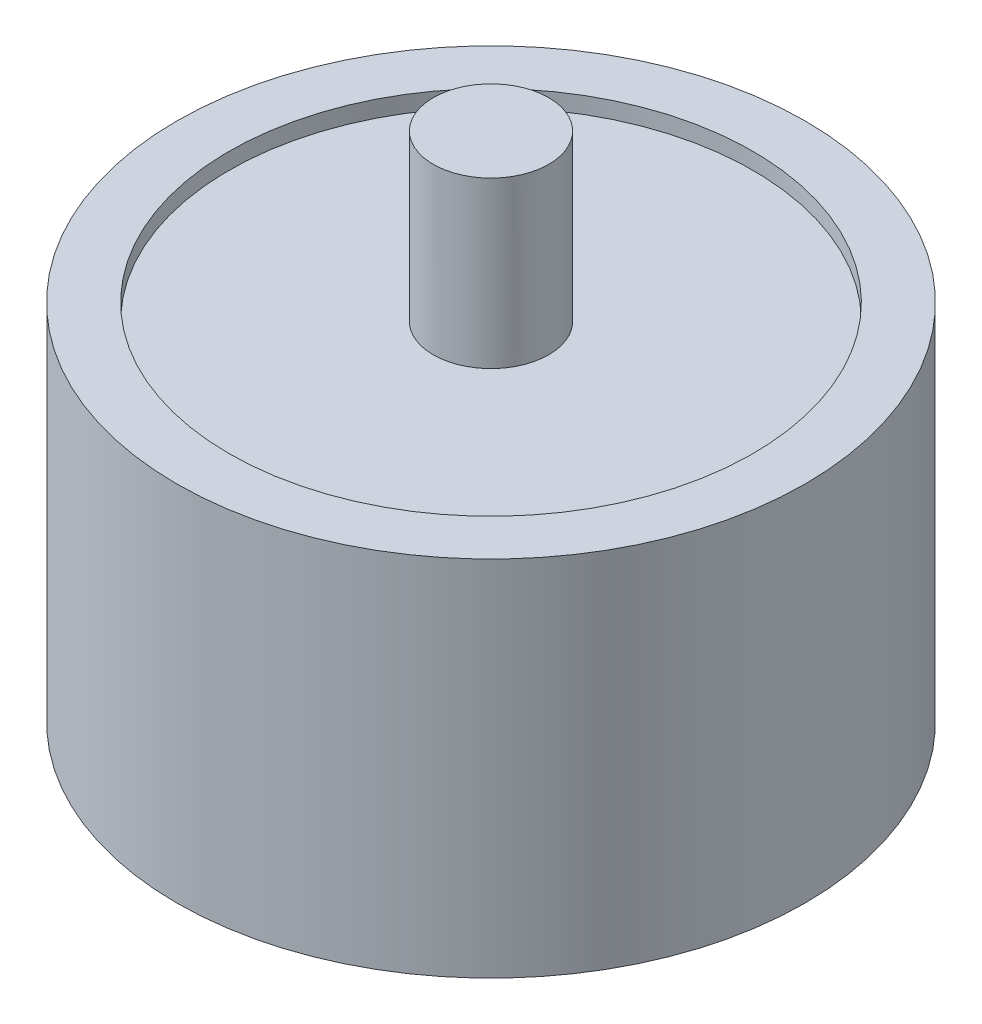
ISO-10303-21;
HEADER;
FILE_DESCRIPTION(('STEP AP214'),'2;1');
FILE_NAME('part.step','',(''),(''),'','','');
FILE_SCHEMA(('AUTOMOTIVE_DESIGN { 1 0 10303 214 1 1 1 1 }'));
ENDSEC;
DATA;
#1=APPLICATION_CONTEXT('core data for automotive mechanical design processes');
#2=APPLICATION_PROTOCOL_DEFINITION('international standard','automotive_design',2000,#1);
#3=PRODUCT_CONTEXT('',#1,'mechanical');
#4=PRODUCT('Part','Part','',(#3));
#5=PRODUCT_RELATED_PRODUCT_CATEGORY('part','',(#4));
#6=PRODUCT_DEFINITION_FORMATION('','',#4);
#7=PRODUCT_DEFINITION_CONTEXT('part definition',#1,'design');
#8=PRODUCT_DEFINITION('design','',#6,#7);
#9=PRODUCT_DEFINITION_SHAPE('','',#8);
#10=(LENGTH_UNIT() NAMED_UNIT(*) SI_UNIT(.MILLI.,.METRE.));
#11=(NAMED_UNIT(*) PLANE_ANGLE_UNIT() SI_UNIT($,.RADIAN.));
#12=(NAMED_UNIT(*) SI_UNIT($,.STERADIAN.) SOLID_ANGLE_UNIT());
#13=UNCERTAINTY_MEASURE_WITH_UNIT(LENGTH_MEASURE(1.E-05),#10,'distance_accuracy_value','');
#14=(GEOMETRIC_REPRESENTATION_CONTEXT(3) GLOBAL_UNCERTAINTY_ASSIGNED_CONTEXT((#13)) GLOBAL_UNIT_ASSIGNED_CONTEXT((#10,
#11,#12)) REPRESENTATION_CONTEXT('',''));
#15=CARTESIAN_POINT('',(0.,0.,0.));
#16=DIRECTION('',(0.,0.,1.));
#17=DIRECTION('',(1.,0.,0.));
#18=AXIS2_PLACEMENT_3D('',#15,#16,#17);
#19=CARTESIAN_POINT('',(0.,20.,0.));
#20=DIRECTION('',(0.,1.,0.));
#21=DIRECTION('',(0.,0.,1.));
#22=AXIS2_PLACEMENT_3D('',#19,#20,#21);
#23=PLANE('',#22);
#24=CARTESIAN_POINT('',(0.,20.,0.));
#25=DIRECTION('',(0.,1.,0.));
#26=DIRECTION('',(0.,0.,1.));
#27=AXIS2_PLACEMENT_3D('',#24,#25,#26);
#28=CIRCLE('',#27,3.5);
#29=CARTESIAN_POINT('',(0.,20.,3.5));
#30=VERTEX_POINT('',#29);
#31=EDGE_CURVE('E10',#30,#30,#28,.T.);
#32=ORIENTED_EDGE('',*,*,#31,.F.);
#33=EDGE_LOOP('',(#32));
#34=FACE_BOUND('',#33,.T.);
#35=CARTESIAN_POINT('',(0.,20.,0.));
#36=DIRECTION('',(0.,1.,0.));
#37=DIRECTION('',(0.,0.,1.));
#38=AXIS2_PLACEMENT_3D('',#35,#36,#37);
#39=CIRCLE('',#38,15.875);
#40=CARTESIAN_POINT('',(0.,20.,15.875));
#41=VERTEX_POINT('',#40);
#42=EDGE_CURVE('E51',#41,#41,#39,.F.);
#43=ORIENTED_EDGE('',*,*,#42,.F.);
#44=EDGE_LOOP('',(#43));
#45=FACE_BOUND('',#44,.T.);
#46=ADVANCED_FACE('F31',(#34,#45),#23,.T.);
#47=CARTESIAN_POINT('',(0.,30.,0.));
#48=DIRECTION('',(0.,-1.,0.));
#49=DIRECTION('',(0.,0.,-1.));
#50=AXIS2_PLACEMENT_3D('',#47,#48,#49);
#51=CYLINDRICAL_SURFACE('',#50,3.5);
#52=ORIENTED_EDGE('',*,*,#31,.T.);
#53=EDGE_LOOP('',(#52));
#54=FACE_BOUND('',#53,.T.);
#55=CARTESIAN_POINT('',(0.,30.,0.));
#56=DIRECTION('',(0.,-1.,0.));
#57=DIRECTION('',(0.,0.,-1.));
#58=AXIS2_PLACEMENT_3D('',#55,#56,#57);
#59=CIRCLE('',#58,3.5);
#60=CARTESIAN_POINT('',(0.,30.,-3.5));
#61=VERTEX_POINT('',#60);
#62=EDGE_CURVE('E45',#61,#61,#59,.T.);
#63=ORIENTED_EDGE('',*,*,#62,.T.);
#64=EDGE_LOOP('',(#63));
#65=FACE_BOUND('',#64,.T.);
#66=ADVANCED_FACE('F88',(#54,#65),#51,.T.);
#67=CARTESIAN_POINT('',(0.,30.,0.));
#68=DIRECTION('',(0.,-1.,0.));
#69=DIRECTION('',(0.,0.,-1.));
#70=AXIS2_PLACEMENT_3D('',#67,#68,#69);
#71=PLANE('',#70);
#72=ORIENTED_EDGE('',*,*,#62,.F.);
#73=EDGE_LOOP('',(#72));
#74=FACE_BOUND('',#73,.T.);
#75=ADVANCED_FACE('F74',(#74),#71,.F.);
#76=CARTESIAN_POINT('',(0.,21.,0.));
#77=DIRECTION('',(0.,-1.,0.));
#78=DIRECTION('',(0.,0.,-1.));
#79=AXIS2_PLACEMENT_3D('',#76,#77,#78);
#80=CYLINDRICAL_SURFACE('',#79,15.875);
#81=CARTESIAN_POINT('',(0.,-1.,0.));
#82=DIRECTION('',(0.,1.,0.));
#83=DIRECTION('',(0.,0.,1.));
#84=AXIS2_PLACEMENT_3D('',#81,#82,#83);
#85=CIRCLE('',#84,15.875);
#86=CARTESIAN_POINT('',(0.,-1.,15.875));
#87=VERTEX_POINT('',#86);
#88=EDGE_CURVE('E63',#87,#87,#85,.T.);
#89=ORIENTED_EDGE('',*,*,#88,.F.);
#90=EDGE_LOOP('',(#89));
#91=FACE_BOUND('',#90,.T.);
#92=CARTESIAN_POINT('',(0.,0.,0.));
#93=DIRECTION('',(0.,1.,0.));
#94=DIRECTION('',(0.,0.,1.));
#95=AXIS2_PLACEMENT_3D('',#92,#93,#94);
#96=CIRCLE('',#95,15.875);
#97=CARTESIAN_POINT('',(0.,0.,15.875));
#98=VERTEX_POINT('',#97);
#99=EDGE_CURVE('E39',#98,#98,#96,.T.);
#100=ORIENTED_EDGE('',*,*,#99,.T.);
#101=EDGE_LOOP('',(#100));
#102=FACE_BOUND('',#101,.T.);
#103=ADVANCED_FACE('F70',(#91,#102),#80,.F.);
#104=CARTESIAN_POINT('',(0.,21.,0.));
#105=DIRECTION('',(0.,1.,0.));
#106=DIRECTION('',(0.,0.,1.));
#107=AXIS2_PLACEMENT_3D('',#104,#105,#106);
#108=PLANE('',#107);
#109=CARTESIAN_POINT('',(0.,21.,0.));
#110=DIRECTION('',(0.,1.,0.));
#111=DIRECTION('',(0.,0.,1.));
#112=AXIS2_PLACEMENT_3D('',#109,#110,#111);
#113=CIRCLE('',#112,19.05);
#114=CARTESIAN_POINT('',(0.,21.,19.05));
#115=VERTEX_POINT('',#114);
#116=EDGE_CURVE('E54',#115,#115,#113,.T.);
#117=ORIENTED_EDGE('',*,*,#116,.T.);
#118=EDGE_LOOP('',(#117));
#119=FACE_BOUND('',#118,.T.);
#120=CARTESIAN_POINT('',(0.,21.,0.));
#121=DIRECTION('',(0.,1.,0.));
#122=DIRECTION('',(0.,0.,1.));
#123=AXIS2_PLACEMENT_3D('',#120,#121,#122);
#124=CIRCLE('',#123,15.875);
#125=CARTESIAN_POINT('',(0.,21.,15.875));
#126=VERTEX_POINT('',#125);
#127=EDGE_CURVE('E57',#126,#126,#124,.T.);
#128=ORIENTED_EDGE('',*,*,#127,.F.);
#129=EDGE_LOOP('',(#128));
#130=FACE_BOUND('',#129,.T.);
#131=ADVANCED_FACE('F73',(#119,#130),#108,.T.);
#132=CARTESIAN_POINT('',(0.,21.,0.));
#133=DIRECTION('',(0.,-1.,0.));
#134=DIRECTION('',(0.,0.,-1.));
#135=AXIS2_PLACEMENT_3D('',#132,#133,#134);
#136=CYLINDRICAL_SURFACE('',#135,19.05);
#137=ORIENTED_EDGE('',*,*,#116,.F.);
#138=EDGE_LOOP('',(#137));
#139=FACE_BOUND('',#138,.T.);
#140=CARTESIAN_POINT('',(0.,-1.,0.));
#141=DIRECTION('',(0.,1.,0.));
#142=DIRECTION('',(0.,0.,1.));
#143=AXIS2_PLACEMENT_3D('',#140,#141,#142);
#144=CIRCLE('',#143,19.05);
#145=CARTESIAN_POINT('',(0.,-1.,19.05));
#146=VERTEX_POINT('',#145);
#147=EDGE_CURVE('E60',#146,#146,#144,.T.);
#148=ORIENTED_EDGE('',*,*,#147,.T.);
#149=EDGE_LOOP('',(#148));
#150=FACE_BOUND('',#149,.T.);
#151=ADVANCED_FACE('F103',(#139,#150),#136,.T.);
#152=ORIENTED_EDGE('',*,*,#42,.T.);
#153=EDGE_LOOP('',(#152));
#154=FACE_BOUND('',#153,.T.);
#155=ORIENTED_EDGE('',*,*,#127,.T.);
#156=EDGE_LOOP('',(#155));
#157=FACE_BOUND('',#156,.T.);
#158=ADVANCED_FACE('F76',(#154,#157),#80,.F.);
#159=CARTESIAN_POINT('',(0.,-1.,0.));
#160=DIRECTION('',(0.,1.,0.));
#161=DIRECTION('',(0.,0.,1.));
#162=AXIS2_PLACEMENT_3D('',#159,#160,#161);
#163=PLANE('',#162);
#164=ORIENTED_EDGE('',*,*,#88,.T.);
#165=EDGE_LOOP('',(#164));
#166=FACE_BOUND('',#165,.T.);
#167=ORIENTED_EDGE('',*,*,#147,.F.);
#168=EDGE_LOOP('',(#167));
#169=FACE_BOUND('',#168,.T.);
#170=ADVANCED_FACE('F67',(#166,#169),#163,.F.);
#171=CARTESIAN_POINT('',(0.,-10.,0.));
#172=DIRECTION('',(0.,-1.,0.));
#173=DIRECTION('',(0.,0.,-1.));
#174=AXIS2_PLACEMENT_3D('',#171,#172,#173);
#175=PLANE('',#174);
#176=CARTESIAN_POINT('',(0.,-10.,0.));
#177=DIRECTION('',(0.,-1.,0.));
#178=DIRECTION('',(0.,0.,-1.));
#179=AXIS2_PLACEMENT_3D('',#176,#177,#178);
#180=CIRCLE('',#179,3.5);
#181=CARTESIAN_POINT('',(0.,-10.,-3.5));
#182=VERTEX_POINT('',#181);
#183=EDGE_CURVE('E48',#182,#182,#180,.T.);
#184=ORIENTED_EDGE('',*,*,#183,.T.);
#185=EDGE_LOOP('',(#184));
#186=FACE_BOUND('',#185,.T.);
#187=ADVANCED_FACE('F85',(#186),#175,.T.);
#188=ORIENTED_EDGE('',*,*,#183,.F.);
#189=EDGE_LOOP('',(#188));
#190=FACE_BOUND('',#189,.T.);
#191=CARTESIAN_POINT('',(0.,0.,0.));
#192=DIRECTION('',(0.,1.,0.));
#193=DIRECTION('',(0.,0.,1.));
#194=AXIS2_PLACEMENT_3D('',#191,#192,#193);
#195=CIRCLE('',#194,3.5);
#196=CARTESIAN_POINT('',(0.,0.,3.5));
#197=VERTEX_POINT('',#196);
#198=EDGE_CURVE('E35',#197,#197,#195,.T.);
#199=ORIENTED_EDGE('',*,*,#198,.F.);
#200=EDGE_LOOP('',(#199));
#201=FACE_BOUND('',#200,.T.);
#202=ADVANCED_FACE('F80',(#190,#201),#51,.T.);
#203=CARTESIAN_POINT('',(0.,0.,0.));
#204=DIRECTION('',(0.,1.,0.));
#205=DIRECTION('',(0.,0.,1.));
#206=AXIS2_PLACEMENT_3D('',#203,#204,#205);
#207=PLANE('',#206);
#208=ORIENTED_EDGE('',*,*,#198,.T.);
#209=EDGE_LOOP('',(#208));
#210=FACE_BOUND('',#209,.T.);
#211=ORIENTED_EDGE('',*,*,#99,.F.);
#212=EDGE_LOOP('',(#211));
#213=FACE_BOUND('',#212,.T.);
#214=ADVANCED_FACE('F33',(#210,#213),#207,.F.);
#215=CLOSED_SHELL('',(#46,#66,#75,#103,#131,#151,#158,#170,#187,#202,#214));
#216=MANIFOLD_SOLID_BREP('B2',#215);
#217=ADVANCED_BREP_SHAPE_REPRESENTATION('',(#18,#216),#14);
#218=SHAPE_DEFINITION_REPRESENTATION(#9,#217);
ENDSEC;
END-ISO-10303-21;
